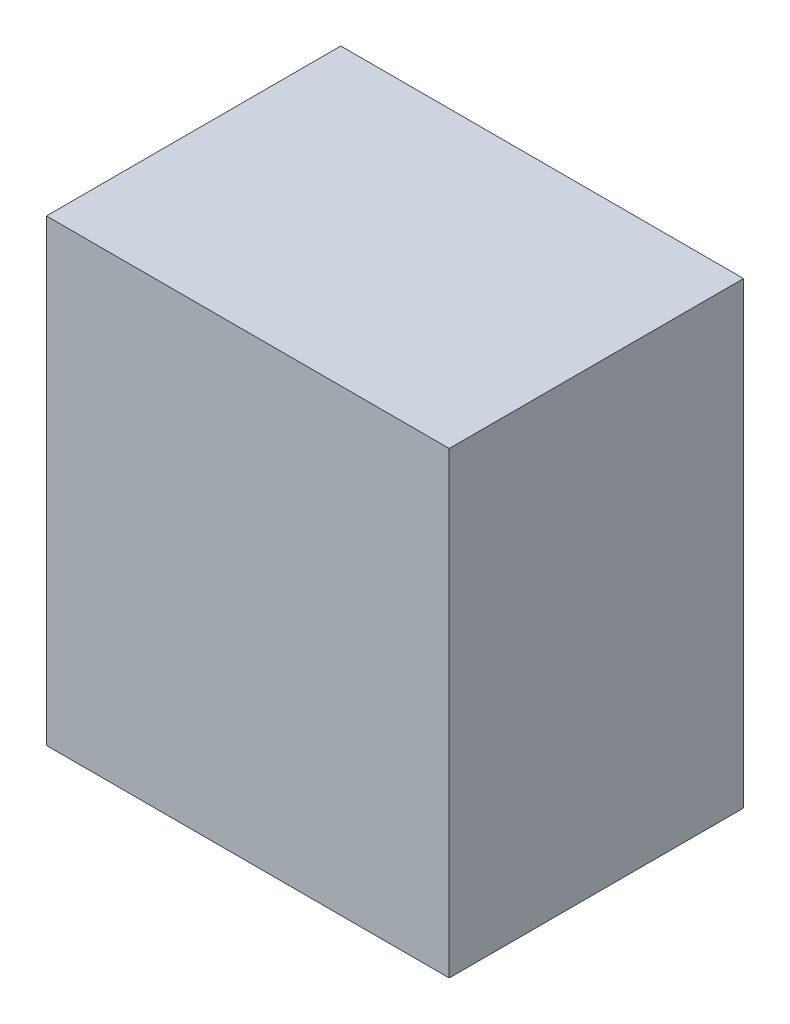
ISO-10303-21;
HEADER;
FILE_DESCRIPTION(('STEP AP214'),'2;1');
FILE_NAME('part.step','',(''),(''),'','','');
FILE_SCHEMA(('AUTOMOTIVE_DESIGN { 1 0 10303 214 1 1 1 1 }'));
ENDSEC;
DATA;
#1=APPLICATION_CONTEXT('core data for automotive mechanical design processes');
#2=APPLICATION_PROTOCOL_DEFINITION('international standard','automotive_design',2000,#1);
#3=PRODUCT_CONTEXT('',#1,'mechanical');
#4=PRODUCT('Part','Part','',(#3));
#5=PRODUCT_RELATED_PRODUCT_CATEGORY('part','',(#4));
#6=PRODUCT_DEFINITION_FORMATION('','',#4);
#7=PRODUCT_DEFINITION_CONTEXT('part definition',#1,'design');
#8=PRODUCT_DEFINITION('design','',#6,#7);
#9=PRODUCT_DEFINITION_SHAPE('','',#8);
#10=(LENGTH_UNIT() NAMED_UNIT(*) SI_UNIT(.MILLI.,.METRE.));
#11=(NAMED_UNIT(*) PLANE_ANGLE_UNIT() SI_UNIT($,.RADIAN.));
#12=(NAMED_UNIT(*) SI_UNIT($,.STERADIAN.) SOLID_ANGLE_UNIT());
#13=UNCERTAINTY_MEASURE_WITH_UNIT(LENGTH_MEASURE(1.E-05),#10,'distance_accuracy_value','');
#14=(GEOMETRIC_REPRESENTATION_CONTEXT(3) GLOBAL_UNCERTAINTY_ASSIGNED_CONTEXT((#13)) GLOBAL_UNIT_ASSIGNED_CONTEXT((#10,
#11,#12)) REPRESENTATION_CONTEXT('',''));
#15=CARTESIAN_POINT('',(0.,0.,0.));
#16=DIRECTION('',(0.,0.,1.));
#17=DIRECTION('',(1.,0.,0.));
#18=AXIS2_PLACEMENT_3D('',#15,#16,#17);
#19=CARTESIAN_POINT('',(-6.4999997,7.3999979,9.49999878));
#20=DIRECTION('',(0.,0.,1.));
#21=DIRECTION('',(1.,0.,0.));
#22=AXIS2_PLACEMENT_3D('',#19,#20,#21);
#23=PLANE('',#22);
#24=DIRECTION('',(0.,1.,0.));
#25=VECTOR('',#24,1.);
#26=CARTESIAN_POINT('',(6.4999997,7.3999979,9.49999878));
#27=LINE('',#26,#25);
#28=CARTESIAN_POINT('',(6.4999997,7.3999979,9.49999878));
#29=VERTEX_POINT('',#28);
#30=CARTESIAN_POINT('',(6.4999997,-7.3999979,9.49999878));
#31=VERTEX_POINT('',#30);
#32=EDGE_CURVE('E53',#29,#31,#27,.F.);
#33=ORIENTED_EDGE('',*,*,#32,.F.);
#34=DIRECTION('',(1.,0.,0.));
#35=VECTOR('',#34,1.);
#36=CARTESIAN_POINT('',(-6.4999997,7.3999979,9.49999878));
#37=LINE('',#36,#35);
#38=CARTESIAN_POINT('',(-6.4999997,7.3999979,9.49999878));
#39=VERTEX_POINT('',#38);
#40=EDGE_CURVE('E68',#39,#29,#37,.T.);
#41=ORIENTED_EDGE('',*,*,#40,.F.);
#42=DIRECTION('',(0.,1.,0.));
#43=VECTOR('',#42,1.);
#44=CARTESIAN_POINT('',(-6.4999997,-7.3999979,9.49999878));
#45=LINE('',#44,#43);
#46=CARTESIAN_POINT('',(-6.4999997,-7.3999979,9.49999878));
#47=VERTEX_POINT('',#46);
#48=EDGE_CURVE('E20',#47,#39,#45,.T.);
#49=ORIENTED_EDGE('',*,*,#48,.F.);
#50=DIRECTION('',(1.,0.,0.));
#51=VECTOR('',#50,1.);
#52=CARTESIAN_POINT('',(6.4999997,-7.3999979,9.49999878));
#53=LINE('',#52,#51);
#54=EDGE_CURVE('E58',#31,#47,#53,.F.);
#55=ORIENTED_EDGE('',*,*,#54,.F.);
#56=EDGE_LOOP('',(#33,#41,#49,#55));
#57=FACE_BOUND('',#56,.T.);
#58=ADVANCED_FACE('F17',(#57),#23,.T.);
#59=CARTESIAN_POINT('',(-6.4999997,-7.3999979,0.));
#60=DIRECTION('',(-1.,0.,0.));
#61=DIRECTION('',(0.,0.,1.));
#62=AXIS2_PLACEMENT_3D('',#59,#60,#61);
#63=PLANE('',#62);
#64=DIRECTION('',(0.,0.,1.));
#65=VECTOR('',#64,1.);
#66=CARTESIAN_POINT('',(-6.4999997,7.3999979,0.));
#67=LINE('',#66,#65);
#68=CARTESIAN_POINT('',(-6.4999997,7.3999979,0.));
#69=VERTEX_POINT('',#68);
#70=EDGE_CURVE('E79',#69,#39,#67,.T.);
#71=ORIENTED_EDGE('',*,*,#70,.F.);
#72=DIRECTION('',(0.,1.,0.));
#73=VECTOR('',#72,1.);
#74=CARTESIAN_POINT('',(-6.4999997,7.3999979,0.));
#75=LINE('',#74,#73);
#76=CARTESIAN_POINT('',(-6.4999997,-7.3999979,0.));
#77=VERTEX_POINT('',#76);
#78=EDGE_CURVE('E74',#69,#77,#75,.F.);
#79=ORIENTED_EDGE('',*,*,#78,.T.);
#80=DIRECTION('',(0.,0.,-1.));
#81=VECTOR('',#80,1.);
#82=CARTESIAN_POINT('',(-6.4999997,-7.3999979,0.));
#83=LINE('',#82,#81);
#84=EDGE_CURVE('E63',#47,#77,#83,.T.);
#85=ORIENTED_EDGE('',*,*,#84,.F.);
#86=ORIENTED_EDGE('',*,*,#48,.T.);
#87=EDGE_LOOP('',(#71,#79,#85,#86));
#88=FACE_BOUND('',#87,.T.);
#89=ADVANCED_FACE('F73',(#88),#63,.T.);
#90=CARTESIAN_POINT('',(6.4999997,-7.3999979,0.));
#91=DIRECTION('',(0.,-1.,0.));
#92=DIRECTION('',(0.,0.,-1.));
#93=AXIS2_PLACEMENT_3D('',#90,#91,#92);
#94=PLANE('',#93);
#95=ORIENTED_EDGE('',*,*,#84,.T.);
#96=DIRECTION('',(1.,0.,0.));
#97=VECTOR('',#96,1.);
#98=CARTESIAN_POINT('',(-6.4999997,-7.3999979,0.));
#99=LINE('',#98,#97);
#100=CARTESIAN_POINT('',(6.4999997,-7.3999979,0.));
#101=VERTEX_POINT('',#100);
#102=EDGE_CURVE('E84',#77,#101,#99,.T.);
#103=ORIENTED_EDGE('',*,*,#102,.T.);
#104=DIRECTION('',(0.,0.,-1.));
#105=VECTOR('',#104,1.);
#106=CARTESIAN_POINT('',(6.4999997,-7.3999979,0.));
#107=LINE('',#106,#105);
#108=EDGE_CURVE('E65',#31,#101,#107,.T.);
#109=ORIENTED_EDGE('',*,*,#108,.F.);
#110=ORIENTED_EDGE('',*,*,#54,.T.);
#111=EDGE_LOOP('',(#95,#103,#109,#110));
#112=FACE_BOUND('',#111,.T.);
#113=ADVANCED_FACE('F60',(#112),#94,.T.);
#114=CARTESIAN_POINT('',(6.4999997,7.3999979,0.));
#115=DIRECTION('',(1.,0.,0.));
#116=DIRECTION('',(0.,0.,-1.));
#117=AXIS2_PLACEMENT_3D('',#114,#115,#116);
#118=PLANE('',#117);
#119=ORIENTED_EDGE('',*,*,#108,.T.);
#120=DIRECTION('',(0.,1.,0.));
#121=VECTOR('',#120,1.);
#122=CARTESIAN_POINT('',(6.4999997,7.3999979,0.));
#123=LINE('',#122,#121);
#124=CARTESIAN_POINT('',(6.4999997,7.3999979,0.));
#125=VERTEX_POINT('',#124);
#126=EDGE_CURVE('E26',#101,#125,#123,.T.);
#127=ORIENTED_EDGE('',*,*,#126,.T.);
#128=DIRECTION('',(0.,0.,1.));
#129=VECTOR('',#128,1.);
#130=CARTESIAN_POINT('',(6.4999997,7.3999979,0.));
#131=LINE('',#130,#129);
#132=EDGE_CURVE('E34',#29,#125,#131,.F.);
#133=ORIENTED_EDGE('',*,*,#132,.F.);
#134=ORIENTED_EDGE('',*,*,#32,.T.);
#135=EDGE_LOOP('',(#119,#127,#133,#134));
#136=FACE_BOUND('',#135,.T.);
#137=ADVANCED_FACE('F88',(#136),#118,.T.);
#138=CARTESIAN_POINT('',(-6.4999997,7.3999979,0.));
#139=DIRECTION('',(0.,1.,0.));
#140=DIRECTION('',(0.,0.,1.));
#141=AXIS2_PLACEMENT_3D('',#138,#139,#140);
#142=PLANE('',#141);
#143=ORIENTED_EDGE('',*,*,#132,.T.);
#144=DIRECTION('',(1.,0.,0.));
#145=VECTOR('',#144,1.);
#146=CARTESIAN_POINT('',(-6.4999997,7.3999979,0.));
#147=LINE('',#146,#145);
#148=EDGE_CURVE('E11',#125,#69,#147,.F.);
#149=ORIENTED_EDGE('',*,*,#148,.T.);
#150=ORIENTED_EDGE('',*,*,#70,.T.);
#151=ORIENTED_EDGE('',*,*,#40,.T.);
#152=EDGE_LOOP('',(#143,#149,#150,#151));
#153=FACE_BOUND('',#152,.T.);
#154=ADVANCED_FACE('F91',(#153),#142,.T.);
#155=CARTESIAN_POINT('',(-6.4999997,7.3999979,0.));
#156=DIRECTION('',(0.,0.,1.));
#157=DIRECTION('',(1.,0.,0.));
#158=AXIS2_PLACEMENT_3D('',#155,#156,#157);
#159=PLANE('',#158);
#160=ORIENTED_EDGE('',*,*,#126,.F.);
#161=ORIENTED_EDGE('',*,*,#102,.F.);
#162=ORIENTED_EDGE('',*,*,#78,.F.);
#163=ORIENTED_EDGE('',*,*,#148,.F.);
#164=EDGE_LOOP('',(#160,#161,#162,#163));
#165=FACE_BOUND('',#164,.T.);
#166=ADVANCED_FACE('F90',(#165),#159,.F.);
#167=CLOSED_SHELL('',(#58,#89,#113,#137,#154,#166));
#168=MANIFOLD_SOLID_BREP('B1',#167);
#169=ADVANCED_BREP_SHAPE_REPRESENTATION('',(#18,#168),#14);
#170=SHAPE_DEFINITION_REPRESENTATION(#9,#169);
ENDSEC;
END-ISO-10303-21;
